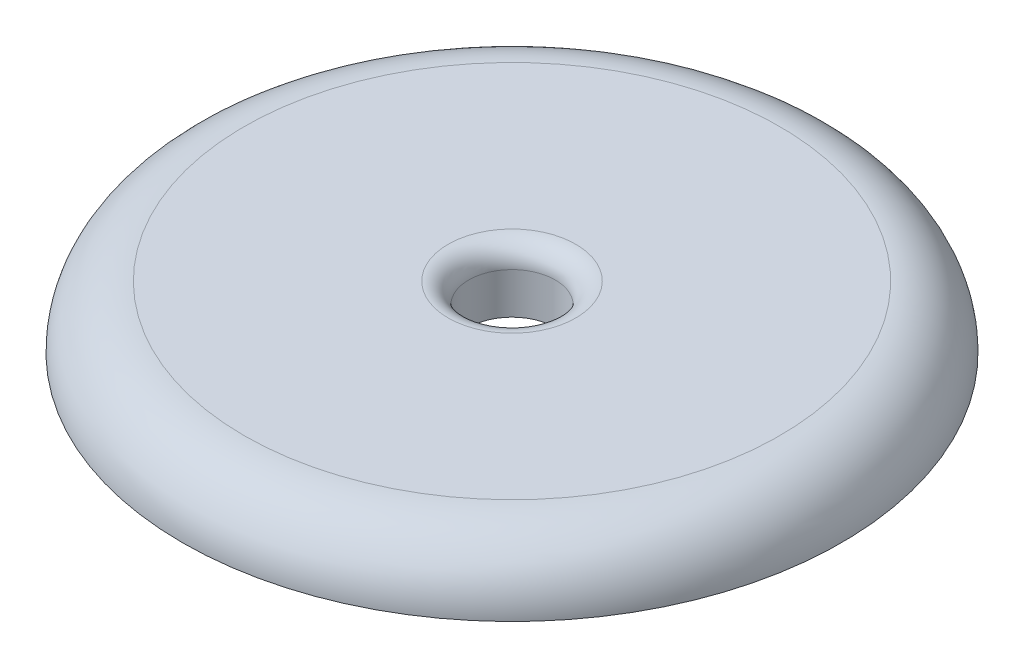
ISO-10303-21;
HEADER;
FILE_DESCRIPTION(('STEP AP214'),'2;1');
FILE_NAME('part.step','',(''),(''),'','','');
FILE_SCHEMA(('AUTOMOTIVE_DESIGN { 1 0 10303 214 1 1 1 1 }'));
ENDSEC;
DATA;
#1=APPLICATION_CONTEXT('core data for automotive mechanical design processes');
#2=APPLICATION_PROTOCOL_DEFINITION('international standard','automotive_design',2000,#1);
#3=PRODUCT_CONTEXT('',#1,'mechanical');
#4=PRODUCT('Part','Part','',(#3));
#5=PRODUCT_RELATED_PRODUCT_CATEGORY('part','',(#4));
#6=PRODUCT_DEFINITION_FORMATION('','',#4);
#7=PRODUCT_DEFINITION_CONTEXT('part definition',#1,'design');
#8=PRODUCT_DEFINITION('design','',#6,#7);
#9=PRODUCT_DEFINITION_SHAPE('','',#8);
#10=(LENGTH_UNIT() NAMED_UNIT(*) SI_UNIT(.MILLI.,.METRE.));
#11=(NAMED_UNIT(*) PLANE_ANGLE_UNIT() SI_UNIT($,.RADIAN.));
#12=(NAMED_UNIT(*) SI_UNIT($,.STERADIAN.) SOLID_ANGLE_UNIT());
#13=UNCERTAINTY_MEASURE_WITH_UNIT(LENGTH_MEASURE(1.E-05),#10,'distance_accuracy_value','');
#14=(GEOMETRIC_REPRESENTATION_CONTEXT(3) GLOBAL_UNCERTAINTY_ASSIGNED_CONTEXT((#13)) GLOBAL_UNIT_ASSIGNED_CONTEXT((#10,
#11,#12)) REPRESENTATION_CONTEXT('',''));
#15=CARTESIAN_POINT('',(0.,0.,0.));
#16=DIRECTION('',(0.,0.,1.));
#17=DIRECTION('',(1.,0.,0.));
#18=AXIS2_PLACEMENT_3D('',#15,#16,#17);
#19=CARTESIAN_POINT('',(0.,3.,-0.566108198309484));
#20=DIRECTION('',(0.,1.,0.));
#21=DIRECTION('',(0.,0.,1.));
#22=AXIS2_PLACEMENT_3D('',#19,#20,#21);
#23=PLANE('',#22);
#24=CARTESIAN_POINT('',(0.,3.,-0.566108198309484));
#25=DIRECTION('',(0.,1.,0.));
#26=DIRECTION('',(0.,0.,1.));
#27=AXIS2_PLACEMENT_3D('',#24,#25,#26);
#28=CIRCLE('',#27,3.1);
#29=CARTESIAN_POINT('',(0.,3.,2.53389180169052));
#30=VERTEX_POINT('',#29);
#31=EDGE_CURVE('E10',#30,#30,#28,.F.);
#32=ORIENTED_EDGE('',*,*,#31,.T.);
#33=EDGE_LOOP('',(#32));
#34=FACE_BOUND('',#33,.T.);
#35=CARTESIAN_POINT('',(0.,3.,-0.566108198309484));
#36=DIRECTION('',(0.,1.,0.));
#37=DIRECTION('',(0.,0.,1.));
#38=AXIS2_PLACEMENT_3D('',#35,#36,#37);
#39=CIRCLE('',#38,13.);
#40=CARTESIAN_POINT('',(0.,3.,12.4338918016905));
#41=VERTEX_POINT('',#40);
#42=EDGE_CURVE('E49',#41,#41,#39,.T.);
#43=ORIENTED_EDGE('',*,*,#42,.T.);
#44=EDGE_LOOP('',(#43));
#45=FACE_BOUND('',#44,.T.);
#46=ADVANCED_FACE('F36',(#34,#45),#23,.T.);
#47=CARTESIAN_POINT('',(0.,0.,-0.566108198309484));
#48=DIRECTION('',(0.,1.,0.));
#49=DIRECTION('',(0.,0.,1.));
#50=AXIS2_PLACEMENT_3D('',#47,#48,#49);
#51=PLANE('',#50);
#52=CARTESIAN_POINT('',(0.,0.,-0.566108198309484));
#53=DIRECTION('',(0.,1.,0.));
#54=DIRECTION('',(0.,0.,1.));
#55=AXIS2_PLACEMENT_3D('',#52,#53,#54);
#56=CIRCLE('',#55,16.);
#57=CARTESIAN_POINT('',(0.,0.,15.4338918016905));
#58=VERTEX_POINT('',#57);
#59=EDGE_CURVE('E54',#58,#58,#56,.T.);
#60=ORIENTED_EDGE('',*,*,#59,.F.);
#61=EDGE_LOOP('',(#60));
#62=FACE_BOUND('',#61,.T.);
#63=CARTESIAN_POINT('',(0.,0.,-0.566108198309484));
#64=DIRECTION('',(0.,1.,0.));
#65=DIRECTION('',(0.,0.,1.));
#66=AXIS2_PLACEMENT_3D('',#63,#64,#65);
#67=CIRCLE('',#66,2.1);
#68=CARTESIAN_POINT('',(0.,0.,1.53389180169052));
#69=VERTEX_POINT('',#68);
#70=EDGE_CURVE('E60',#69,#69,#67,.T.);
#71=ORIENTED_EDGE('',*,*,#70,.T.);
#72=EDGE_LOOP('',(#71));
#73=FACE_BOUND('',#72,.T.);
#74=ADVANCED_FACE('F65',(#62,#73),#51,.F.);
#75=CARTESIAN_POINT('',(0.,3.,-0.566108198309484));
#76=DIRECTION('',(0.,-1.,0.));
#77=DIRECTION('',(0.,0.,-1.));
#78=AXIS2_PLACEMENT_3D('',#75,#76,#77);
#79=CYLINDRICAL_SURFACE('',#78,2.1);
#80=CARTESIAN_POINT('',(0.,2.,-0.566108198309484));
#81=DIRECTION('',(0.,1.,0.));
#82=DIRECTION('',(0.,0.,1.));
#83=AXIS2_PLACEMENT_3D('',#80,#81,#82);
#84=CIRCLE('',#83,2.1);
#85=CARTESIAN_POINT('',(0.,2.,1.53389180169052));
#86=VERTEX_POINT('',#85);
#87=EDGE_CURVE('E44',#86,#86,#84,.T.);
#88=ORIENTED_EDGE('',*,*,#87,.T.);
#89=EDGE_LOOP('',(#88));
#90=FACE_BOUND('',#89,.T.);
#91=ORIENTED_EDGE('',*,*,#70,.F.);
#92=EDGE_LOOP('',(#91));
#93=FACE_BOUND('',#92,.T.);
#94=ADVANCED_FACE('F67',(#90,#93),#79,.F.);
#95=CARTESIAN_POINT('',(0.,0.,-0.566108198309484));
#96=DIRECTION('',(0.,1.,0.));
#97=DIRECTION('',(0.,0.,1.));
#98=AXIS2_PLACEMENT_3D('',#95,#96,#97);
#99=TOROIDAL_SURFACE('',#98,13.,3.);
#100=ORIENTED_EDGE('',*,*,#59,.T.);
#101=EDGE_LOOP('',(#100));
#102=FACE_BOUND('',#101,.T.);
#103=ORIENTED_EDGE('',*,*,#42,.F.);
#104=EDGE_LOOP('',(#103));
#105=FACE_BOUND('',#104,.T.);
#106=ADVANCED_FACE('F69',(#102,#105),#99,.T.);
#107=CARTESIAN_POINT('',(0.,2.,-0.566108198309484));
#108=DIRECTION('',(0.,1.,0.));
#109=DIRECTION('',(0.,0.,1.));
#110=AXIS2_PLACEMENT_3D('',#107,#108,#109);
#111=TOROIDAL_SURFACE('',#110,3.1,1.);
#112=ORIENTED_EDGE('',*,*,#31,.F.);
#113=EDGE_LOOP('',(#112));
#114=FACE_BOUND('',#113,.T.);
#115=ORIENTED_EDGE('',*,*,#87,.F.);
#116=EDGE_LOOP('',(#115));
#117=FACE_BOUND('',#116,.T.);
#118=ADVANCED_FACE('F38',(#114,#117),#111,.T.);
#119=CLOSED_SHELL('',(#46,#74,#94,#106,#118));
#120=MANIFOLD_SOLID_BREP('B2',#119);
#121=ADVANCED_BREP_SHAPE_REPRESENTATION('',(#18,#120),#14);
#122=SHAPE_DEFINITION_REPRESENTATION(#9,#121);
ENDSEC;
END-ISO-10303-21;
